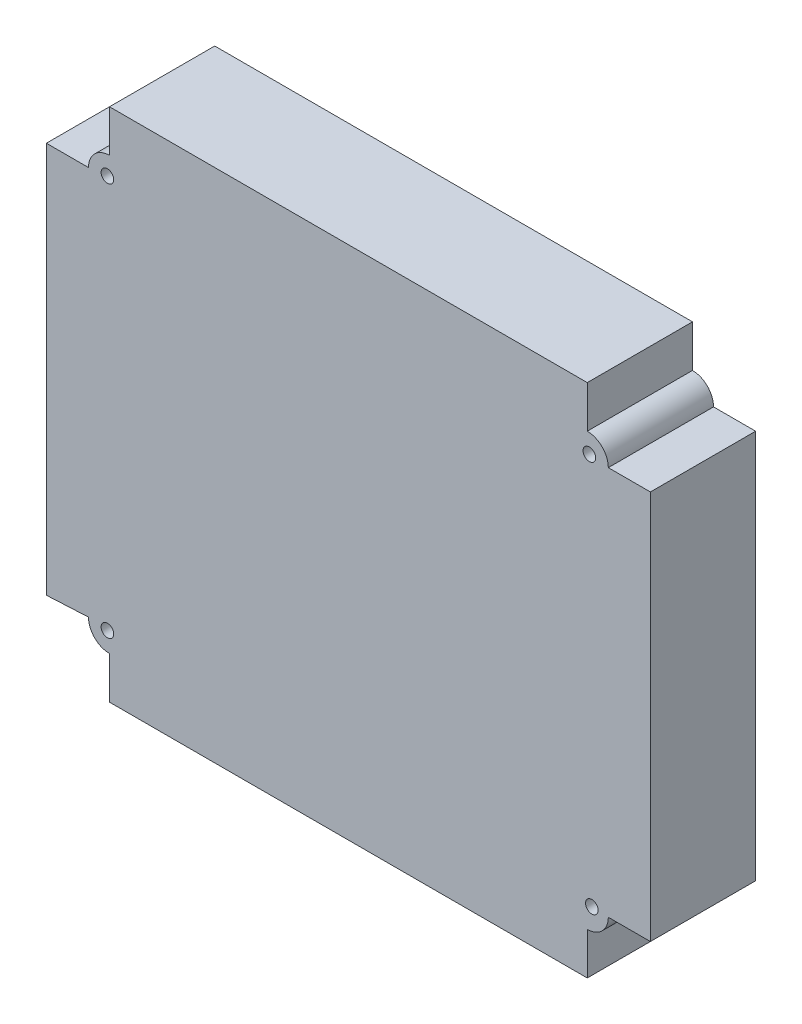
ISO-10303-21;
HEADER;
FILE_DESCRIPTION(('STEP AP214'),'2;1');
FILE_NAME('part.step','',(''),(''),'','','');
FILE_SCHEMA(('AUTOMOTIVE_DESIGN { 1 0 10303 214 1 1 1 1 }'));
ENDSEC;
DATA;
#1=APPLICATION_CONTEXT('core data for automotive mechanical design processes');
#2=APPLICATION_PROTOCOL_DEFINITION('international standard','automotive_design',2000,#1);
#3=PRODUCT_CONTEXT('',#1,'mechanical');
#4=PRODUCT('Part','Part','',(#3));
#5=PRODUCT_RELATED_PRODUCT_CATEGORY('part','',(#4));
#6=PRODUCT_DEFINITION_FORMATION('','',#4);
#7=PRODUCT_DEFINITION_CONTEXT('part definition',#1,'design');
#8=PRODUCT_DEFINITION('design','',#6,#7);
#9=PRODUCT_DEFINITION_SHAPE('','',#8);
#10=(LENGTH_UNIT() NAMED_UNIT(*) SI_UNIT(.MILLI.,.METRE.));
#11=(NAMED_UNIT(*) PLANE_ANGLE_UNIT() SI_UNIT($,.RADIAN.));
#12=(NAMED_UNIT(*) SI_UNIT($,.STERADIAN.) SOLID_ANGLE_UNIT());
#13=UNCERTAINTY_MEASURE_WITH_UNIT(LENGTH_MEASURE(1.E-05),#10,'distance_accuracy_value','');
#14=(GEOMETRIC_REPRESENTATION_CONTEXT(3) GLOBAL_UNCERTAINTY_ASSIGNED_CONTEXT((#13)) GLOBAL_UNIT_ASSIGNED_CONTEXT((#10,
#11,#12)) REPRESENTATION_CONTEXT('',''));
#15=CARTESIAN_POINT('',(0.,0.,0.));
#16=DIRECTION('',(0.,0.,1.));
#17=DIRECTION('',(1.,0.,0.));
#18=AXIS2_PLACEMENT_3D('',#15,#16,#17);
#19=CARTESIAN_POINT('',(-0.98625000004553,5.,25.));
#20=DIRECTION('',(0.,0.,1.));
#21=DIRECTION('',(1.,0.,0.));
#22=AXIS2_PLACEMENT_3D('',#19,#20,#21);
#23=PLANE('',#22);
#24=CARTESIAN_POINT('',(0.095685546854689,5.20116136626515,25.));
#25=DIRECTION('',(0.,0.,1.));
#26=DIRECTION('',(1.,0.,0.));
#27=AXIS2_PLACEMENT_3D('',#24,#25,#26);
#28=CIRCLE('',#27,1.5);
#29=CARTESIAN_POINT('',(1.59568554685469,5.20116136626515,25.));
#30=VERTEX_POINT('',#29);
#31=EDGE_CURVE('E345',#30,#30,#28,.T.);
#32=ORIENTED_EDGE('',*,*,#31,.F.);
#33=EDGE_LOOP('',(#32));
#34=FACE_BOUND('',#33,.T.);
#35=CARTESIAN_POINT('',(-114.986250000046,98.,25.));
#36=DIRECTION('',(0.,0.,1.));
#37=DIRECTION('',(1.,0.,0.));
#38=AXIS2_PLACEMENT_3D('',#35,#36,#37);
#39=CIRCLE('',#38,1.5);
#40=CARTESIAN_POINT('',(-113.486250000046,98.,25.));
#41=VERTEX_POINT('',#40);
#42=EDGE_CURVE('E184',#41,#41,#39,.T.);
#43=ORIENTED_EDGE('',*,*,#42,.F.);
#44=EDGE_LOOP('',(#43));
#45=FACE_BOUND('',#44,.T.);
#46=DIRECTION('',(0.,1.,0.));
#47=VECTOR('',#46,1.);
#48=CARTESIAN_POINT('',(-0.986250000045564,-10.,25.));
#49=LINE('',#48,#47);
#50=CARTESIAN_POINT('',(-0.986250000045564,-10.,25.));
#51=VERTEX_POINT('',#50);
#52=CARTESIAN_POINT('',(-0.986250000045566,0.,25.));
#53=VERTEX_POINT('',#52);
#54=EDGE_CURVE('E211',#51,#53,#49,.T.);
#55=ORIENTED_EDGE('',*,*,#54,.T.);
#56=CARTESIAN_POINT('',(-0.98625000004553,5.,25.));
#57=DIRECTION('',(0.,0.,1.));
#58=DIRECTION('',(1.,0.,0.));
#59=AXIS2_PLACEMENT_3D('',#56,#57,#58);
#60=CIRCLE('',#59,5.);
#61=CARTESIAN_POINT('',(4.01374999995447,5.00000000000003,25.));
#62=VERTEX_POINT('',#61);
#63=EDGE_CURVE('E119',#53,#62,#60,.T.);
#64=ORIENTED_EDGE('',*,*,#63,.T.);
#65=DIRECTION('',(1.,0.,0.));
#66=VECTOR('',#65,1.);
#67=CARTESIAN_POINT('',(4.01374999995447,5.00000000000003,25.));
#68=LINE('',#67,#66);
#69=CARTESIAN_POINT('',(14.0137499999545,5.,25.));
#70=VERTEX_POINT('',#69);
#71=EDGE_CURVE('E250',#62,#70,#68,.T.);
#72=ORIENTED_EDGE('',*,*,#71,.T.);
#73=DIRECTION('',(0.,1.,0.));
#74=VECTOR('',#73,1.);
#75=CARTESIAN_POINT('',(14.0137499999545,5.,25.));
#76=LINE('',#75,#74);
#77=CARTESIAN_POINT('',(14.0137499999545,97.5,25.));
#78=VERTEX_POINT('',#77);
#79=EDGE_CURVE('E269',#70,#78,#76,.T.);
#80=ORIENTED_EDGE('',*,*,#79,.T.);
#81=DIRECTION('',(-1.,0.,0.));
#82=VECTOR('',#81,1.);
#83=CARTESIAN_POINT('',(14.0137499999545,97.5,25.));
#84=LINE('',#83,#82);
#85=CARTESIAN_POINT('',(4.01374999995447,97.5,25.));
#86=VERTEX_POINT('',#85);
#87=EDGE_CURVE('E266',#78,#86,#84,.T.);
#88=ORIENTED_EDGE('',*,*,#87,.T.);
#89=CARTESIAN_POINT('',(-0.986250000045536,97.5,25.));
#90=DIRECTION('',(0.,0.,1.));
#91=DIRECTION('',(-1.,0.,0.));
#92=AXIS2_PLACEMENT_3D('',#89,#90,#91);
#93=CIRCLE('',#92,5.);
#94=CARTESIAN_POINT('',(-0.986250000045571,102.5,25.));
#95=VERTEX_POINT('',#94);
#96=EDGE_CURVE('E268',#86,#95,#93,.T.);
#97=ORIENTED_EDGE('',*,*,#96,.T.);
#98=DIRECTION('',(0.,1.,0.));
#99=VECTOR('',#98,1.);
#100=CARTESIAN_POINT('',(-0.986250000045571,102.5,25.));
#101=LINE('',#100,#99);
#102=CARTESIAN_POINT('',(-0.986250000045541,112.5,25.));
#103=VERTEX_POINT('',#102);
#104=EDGE_CURVE('E271',#95,#103,#101,.T.);
#105=ORIENTED_EDGE('',*,*,#104,.T.);
#106=DIRECTION('',(-1.,0.,0.));
#107=VECTOR('',#106,1.);
#108=CARTESIAN_POINT('',(-0.986250000045541,112.5,25.));
#109=LINE('',#108,#107);
#110=CARTESIAN_POINT('',(-114.486250000045,112.5,25.));
#111=VERTEX_POINT('',#110);
#112=EDGE_CURVE('E277',#103,#111,#109,.T.);
#113=ORIENTED_EDGE('',*,*,#112,.T.);
#114=DIRECTION('',(0.,-1.,0.));
#115=VECTOR('',#114,1.);
#116=CARTESIAN_POINT('',(-114.486250000045,112.5,25.));
#117=LINE('',#116,#115);
#118=CARTESIAN_POINT('',(-114.486250000045,102.5,25.));
#119=VERTEX_POINT('',#118);
#120=EDGE_CURVE('E279',#111,#119,#117,.T.);
#121=ORIENTED_EDGE('',*,*,#120,.T.);
#122=CARTESIAN_POINT('',(-114.486250000046,97.5,25.));
#123=DIRECTION('',(0.,0.,1.));
#124=DIRECTION('',(1.,0.,0.));
#125=AXIS2_PLACEMENT_3D('',#122,#123,#124);
#126=CIRCLE('',#125,5.);
#127=CARTESIAN_POINT('',(-119.486250000046,97.5,25.));
#128=VERTEX_POINT('',#127);
#129=EDGE_CURVE('E281',#119,#128,#126,.T.);
#130=ORIENTED_EDGE('',*,*,#129,.T.);
#131=DIRECTION('',(-1.,0.,0.));
#132=VECTOR('',#131,1.);
#133=CARTESIAN_POINT('',(-119.486250000046,97.5,25.));
#134=LINE('',#133,#132);
#135=CARTESIAN_POINT('',(-129.486250000046,97.5,25.));
#136=VERTEX_POINT('',#135);
#137=EDGE_CURVE('E283',#128,#136,#134,.T.);
#138=ORIENTED_EDGE('',*,*,#137,.T.);
#139=DIRECTION('',(0.,-1.,0.));
#140=VECTOR('',#139,1.);
#141=CARTESIAN_POINT('',(-129.486250000046,97.5,25.));
#142=LINE('',#141,#140);
#143=CARTESIAN_POINT('',(-129.486250000046,4.5,25.));
#144=VERTEX_POINT('',#143);
#145=EDGE_CURVE('E285',#136,#144,#142,.T.);
#146=ORIENTED_EDGE('',*,*,#145,.T.);
#147=DIRECTION('',(0.998752338877845,0.0499376169438958,0.));
#148=VECTOR('',#147,1.);
#149=CARTESIAN_POINT('',(-129.486250000046,4.5,25.));
#150=LINE('',#149,#148);
#151=CARTESIAN_POINT('',(-119.486250000046,5.00000000000003,25.));
#152=VERTEX_POINT('',#151);
#153=EDGE_CURVE('E162',#144,#152,#150,.T.);
#154=ORIENTED_EDGE('',*,*,#153,.T.);
#155=CARTESIAN_POINT('',(-114.486250000046,5.,25.));
#156=DIRECTION('',(0.,0.,1.));
#157=DIRECTION('',(1.,0.,0.));
#158=AXIS2_PLACEMENT_3D('',#155,#156,#157);
#159=CIRCLE('',#158,5.);
#160=CARTESIAN_POINT('',(-114.486250000045,0.,25.));
#161=VERTEX_POINT('',#160);
#162=EDGE_CURVE('E156',#152,#161,#159,.T.);
#163=ORIENTED_EDGE('',*,*,#162,.T.);
#164=DIRECTION('',(0.,-1.,0.));
#165=VECTOR('',#164,1.);
#166=CARTESIAN_POINT('',(-114.486250000045,0.,25.));
#167=LINE('',#166,#165);
#168=CARTESIAN_POINT('',(-114.486250000046,-10.,25.));
#169=VERTEX_POINT('',#168);
#170=EDGE_CURVE('E160',#161,#169,#167,.T.);
#171=ORIENTED_EDGE('',*,*,#170,.T.);
#172=DIRECTION('',(1.,0.,0.));
#173=VECTOR('',#172,1.);
#174=CARTESIAN_POINT('',(-114.486250000046,-10.,25.));
#175=LINE('',#174,#173);
#176=EDGE_CURVE('E52',#169,#51,#175,.T.);
#177=ORIENTED_EDGE('',*,*,#176,.T.);
#178=EDGE_LOOP('',(#55,#64,#72,#80,#88,#97,#105,#113,#121,#130,#138,#146,#154,#163,#171,#177));
#179=FACE_BOUND('',#178,.T.);
#180=CARTESIAN_POINT('',(-114.986250000046,4.5,25.));
#181=DIRECTION('',(0.,0.,1.));
#182=DIRECTION('',(1.,0.,0.));
#183=AXIS2_PLACEMENT_3D('',#180,#181,#182);
#184=CIRCLE('',#183,1.5);
#185=CARTESIAN_POINT('',(-113.486250000046,4.5,25.));
#186=VERTEX_POINT('',#185);
#187=EDGE_CURVE('E351',#186,#186,#184,.T.);
#188=ORIENTED_EDGE('',*,*,#187,.F.);
#189=EDGE_LOOP('',(#188));
#190=FACE_BOUND('',#189,.T.);
#191=CARTESIAN_POINT('',(-0.486250000045534,98.,25.));
#192=DIRECTION('',(0.,0.,1.));
#193=DIRECTION('',(1.,0.,0.));
#194=AXIS2_PLACEMENT_3D('',#191,#192,#193);
#195=CIRCLE('',#194,1.5);
#196=CARTESIAN_POINT('',(1.01374999995447,98.,25.));
#197=VERTEX_POINT('',#196);
#198=EDGE_CURVE('E336',#197,#197,#195,.T.);
#199=ORIENTED_EDGE('',*,*,#198,.F.);
#200=EDGE_LOOP('',(#199));
#201=FACE_BOUND('',#200,.T.);
#202=ADVANCED_FACE('F35',(#34,#45,#179,#190,#201),#23,.T.);
#203=CARTESIAN_POINT('',(-0.98625000004553,5.,0.));
#204=DIRECTION('',(0.,0.,1.));
#205=DIRECTION('',(1.,0.,0.));
#206=AXIS2_PLACEMENT_3D('',#203,#204,#205);
#207=PLANE('',#206);
#208=DIRECTION('',(0.,1.,0.));
#209=VECTOR('',#208,1.);
#210=CARTESIAN_POINT('',(-0.986250000045564,-10.,0.));
#211=LINE('',#210,#209);
#212=CARTESIAN_POINT('',(-0.986250000045564,-10.,0.));
#213=VERTEX_POINT('',#212);
#214=CARTESIAN_POINT('',(-0.986250000045566,0.,0.));
#215=VERTEX_POINT('',#214);
#216=EDGE_CURVE('E180',#213,#215,#211,.T.);
#217=ORIENTED_EDGE('',*,*,#216,.F.);
#218=DIRECTION('',(1.,0.,0.));
#219=VECTOR('',#218,1.);
#220=CARTESIAN_POINT('',(-114.486250000046,-10.,0.));
#221=LINE('',#220,#219);
#222=CARTESIAN_POINT('',(-114.486250000046,-10.,0.));
#223=VERTEX_POINT('',#222);
#224=EDGE_CURVE('E111',#223,#213,#221,.T.);
#225=ORIENTED_EDGE('',*,*,#224,.F.);
#226=DIRECTION('',(0.,-1.,0.));
#227=VECTOR('',#226,1.);
#228=CARTESIAN_POINT('',(-114.486250000045,0.,0.));
#229=LINE('',#228,#227);
#230=CARTESIAN_POINT('',(-114.486250000045,0.,0.));
#231=VERTEX_POINT('',#230);
#232=EDGE_CURVE('E105',#231,#223,#229,.T.);
#233=ORIENTED_EDGE('',*,*,#232,.F.);
#234=CARTESIAN_POINT('',(-114.486250000046,5.,0.));
#235=DIRECTION('',(0.,0.,1.));
#236=DIRECTION('',(1.,0.,0.));
#237=AXIS2_PLACEMENT_3D('',#234,#235,#236);
#238=CIRCLE('',#237,5.);
#239=CARTESIAN_POINT('',(-119.486250000046,5.00000000000003,0.));
#240=VERTEX_POINT('',#239);
#241=EDGE_CURVE('E170',#240,#231,#238,.T.);
#242=ORIENTED_EDGE('',*,*,#241,.F.);
#243=DIRECTION('',(0.998752338877845,0.0499376169438958,0.));
#244=VECTOR('',#243,1.);
#245=CARTESIAN_POINT('',(-129.486250000046,4.5,0.));
#246=LINE('',#245,#244);
#247=CARTESIAN_POINT('',(-129.486250000046,4.5,0.));
#248=VERTEX_POINT('',#247);
#249=EDGE_CURVE('E206',#248,#240,#246,.T.);
#250=ORIENTED_EDGE('',*,*,#249,.F.);
#251=DIRECTION('',(0.,-1.,0.));
#252=VECTOR('',#251,1.);
#253=CARTESIAN_POINT('',(-129.486250000046,97.5,0.));
#254=LINE('',#253,#252);
#255=CARTESIAN_POINT('',(-129.486250000046,97.5,0.));
#256=VERTEX_POINT('',#255);
#257=EDGE_CURVE('E204',#256,#248,#254,.T.);
#258=ORIENTED_EDGE('',*,*,#257,.F.);
#259=DIRECTION('',(-1.,0.,0.));
#260=VECTOR('',#259,1.);
#261=CARTESIAN_POINT('',(-119.486250000046,97.5,0.));
#262=LINE('',#261,#260);
#263=CARTESIAN_POINT('',(-119.486250000046,97.5,0.));
#264=VERTEX_POINT('',#263);
#265=EDGE_CURVE('E202',#264,#256,#262,.T.);
#266=ORIENTED_EDGE('',*,*,#265,.F.);
#267=CARTESIAN_POINT('',(-114.486250000046,97.5,0.));
#268=DIRECTION('',(0.,0.,1.));
#269=DIRECTION('',(1.,0.,0.));
#270=AXIS2_PLACEMENT_3D('',#267,#268,#269);
#271=CIRCLE('',#270,5.);
#272=CARTESIAN_POINT('',(-114.486250000045,102.5,0.));
#273=VERTEX_POINT('',#272);
#274=EDGE_CURVE('E200',#273,#264,#271,.T.);
#275=ORIENTED_EDGE('',*,*,#274,.F.);
#276=DIRECTION('',(0.,-1.,0.));
#277=VECTOR('',#276,1.);
#278=CARTESIAN_POINT('',(-114.486250000045,112.5,0.));
#279=LINE('',#278,#277);
#280=CARTESIAN_POINT('',(-114.486250000045,112.5,0.));
#281=VERTEX_POINT('',#280);
#282=EDGE_CURVE('E198',#281,#273,#279,.T.);
#283=ORIENTED_EDGE('',*,*,#282,.F.);
#284=DIRECTION('',(-1.,0.,0.));
#285=VECTOR('',#284,1.);
#286=CARTESIAN_POINT('',(-0.986250000045541,112.5,0.));
#287=LINE('',#286,#285);
#288=CARTESIAN_POINT('',(-0.986250000045541,112.5,0.));
#289=VERTEX_POINT('',#288);
#290=EDGE_CURVE('E196',#289,#281,#287,.T.);
#291=ORIENTED_EDGE('',*,*,#290,.F.);
#292=DIRECTION('',(0.,1.,0.));
#293=VECTOR('',#292,1.);
#294=CARTESIAN_POINT('',(-0.986250000045571,102.5,0.));
#295=LINE('',#294,#293);
#296=CARTESIAN_POINT('',(-0.986250000045571,102.5,0.));
#297=VERTEX_POINT('',#296);
#298=EDGE_CURVE('E194',#297,#289,#295,.T.);
#299=ORIENTED_EDGE('',*,*,#298,.F.);
#300=CARTESIAN_POINT('',(-0.986250000045536,97.5,0.));
#301=DIRECTION('',(0.,0.,1.));
#302=DIRECTION('',(-1.,0.,0.));
#303=AXIS2_PLACEMENT_3D('',#300,#301,#302);
#304=CIRCLE('',#303,5.);
#305=CARTESIAN_POINT('',(4.01374999995447,97.5,0.));
#306=VERTEX_POINT('',#305);
#307=EDGE_CURVE('E192',#306,#297,#304,.T.);
#308=ORIENTED_EDGE('',*,*,#307,.F.);
#309=DIRECTION('',(-1.,0.,0.));
#310=VECTOR('',#309,1.);
#311=CARTESIAN_POINT('',(14.0137499999545,97.5,0.));
#312=LINE('',#311,#310);
#313=CARTESIAN_POINT('',(14.0137499999545,97.5,0.));
#314=VERTEX_POINT('',#313);
#315=EDGE_CURVE('E190',#314,#306,#312,.T.);
#316=ORIENTED_EDGE('',*,*,#315,.F.);
#317=DIRECTION('',(0.,1.,0.));
#318=VECTOR('',#317,1.);
#319=CARTESIAN_POINT('',(14.0137499999545,5.,0.));
#320=LINE('',#319,#318);
#321=CARTESIAN_POINT('',(14.0137499999545,5.,0.));
#322=VERTEX_POINT('',#321);
#323=EDGE_CURVE('E188',#322,#314,#320,.T.);
#324=ORIENTED_EDGE('',*,*,#323,.F.);
#325=DIRECTION('',(1.,0.,0.));
#326=VECTOR('',#325,1.);
#327=CARTESIAN_POINT('',(4.01374999995447,5.00000000000003,0.));
#328=LINE('',#327,#326);
#329=CARTESIAN_POINT('',(4.01374999995447,5.00000000000003,0.));
#330=VERTEX_POINT('',#329);
#331=EDGE_CURVE('E186',#330,#322,#328,.T.);
#332=ORIENTED_EDGE('',*,*,#331,.F.);
#333=CARTESIAN_POINT('',(-0.98625000004553,5.,0.));
#334=DIRECTION('',(0.,0.,1.));
#335=DIRECTION('',(1.,0.,0.));
#336=AXIS2_PLACEMENT_3D('',#333,#334,#335);
#337=CIRCLE('',#336,5.);
#338=EDGE_CURVE('E183',#215,#330,#337,.T.);
#339=ORIENTED_EDGE('',*,*,#338,.F.);
#340=EDGE_LOOP('',(#217,#225,#233,#242,#250,#258,#266,#275,#283,#291,#299,#308,#316,#324,#332,#339));
#341=FACE_BOUND('',#340,.T.);
#342=CARTESIAN_POINT('',(-114.986250000046,98.,0.));
#343=DIRECTION('',(0.,0.,1.));
#344=DIRECTION('',(1.,0.,0.));
#345=AXIS2_PLACEMENT_3D('',#342,#343,#344);
#346=CIRCLE('',#345,1.5);
#347=CARTESIAN_POINT('',(-113.486250000046,98.,0.));
#348=VERTEX_POINT('',#347);
#349=EDGE_CURVE('E354',#348,#348,#346,.T.);
#350=ORIENTED_EDGE('',*,*,#349,.T.);
#351=EDGE_LOOP('',(#350));
#352=FACE_BOUND('',#351,.T.);
#353=CARTESIAN_POINT('',(-114.986250000046,4.5,0.));
#354=DIRECTION('',(0.,0.,1.));
#355=DIRECTION('',(1.,0.,0.));
#356=AXIS2_PLACEMENT_3D('',#353,#354,#355);
#357=CIRCLE('',#356,1.5);
#358=CARTESIAN_POINT('',(-113.486250000046,4.5,0.));
#359=VERTEX_POINT('',#358);
#360=EDGE_CURVE('E348',#359,#359,#357,.T.);
#361=ORIENTED_EDGE('',*,*,#360,.T.);
#362=EDGE_LOOP('',(#361));
#363=FACE_BOUND('',#362,.T.);
#364=CARTESIAN_POINT('',(0.095685546854689,5.20116136626515,0.));
#365=DIRECTION('',(0.,0.,1.));
#366=DIRECTION('',(1.,0.,0.));
#367=AXIS2_PLACEMENT_3D('',#364,#365,#366);
#368=CIRCLE('',#367,1.5);
#369=CARTESIAN_POINT('',(1.59568554685469,5.20116136626515,0.));
#370=VERTEX_POINT('',#369);
#371=EDGE_CURVE('E342',#370,#370,#368,.T.);
#372=ORIENTED_EDGE('',*,*,#371,.T.);
#373=EDGE_LOOP('',(#372));
#374=FACE_BOUND('',#373,.T.);
#375=CARTESIAN_POINT('',(-0.486250000045534,98.,0.));
#376=DIRECTION('',(0.,0.,1.));
#377=DIRECTION('',(1.,0.,0.));
#378=AXIS2_PLACEMENT_3D('',#375,#376,#377);
#379=CIRCLE('',#378,1.5);
#380=CARTESIAN_POINT('',(1.01374999995447,98.,0.));
#381=VERTEX_POINT('',#380);
#382=EDGE_CURVE('E339',#381,#381,#379,.T.);
#383=ORIENTED_EDGE('',*,*,#382,.T.);
#384=EDGE_LOOP('',(#383));
#385=FACE_BOUND('',#384,.T.);
#386=ADVANCED_FACE('F254',(#341,#352,#363,#374,#385),#207,.F.);
#387=CARTESIAN_POINT('',(-0.986250000045564,-10.,25.));
#388=DIRECTION('',(-1.,0.,0.));
#389=DIRECTION('',(0.,0.,1.));
#390=AXIS2_PLACEMENT_3D('',#387,#388,#389);
#391=PLANE('',#390);
#392=ORIENTED_EDGE('',*,*,#216,.T.);
#393=DIRECTION('',(0.,0.,-1.));
#394=VECTOR('',#393,1.);
#395=CARTESIAN_POINT('',(-0.986250000045566,0.,25.));
#396=LINE('',#395,#394);
#397=EDGE_CURVE('E11',#53,#215,#396,.T.);
#398=ORIENTED_EDGE('',*,*,#397,.F.);
#399=ORIENTED_EDGE('',*,*,#54,.F.);
#400=DIRECTION('',(0.,0.,-1.));
#401=VECTOR('',#400,1.);
#402=CARTESIAN_POINT('',(-0.986250000045564,-10.,25.));
#403=LINE('',#402,#401);
#404=EDGE_CURVE('E176',#51,#213,#403,.T.);
#405=ORIENTED_EDGE('',*,*,#404,.T.);
#406=EDGE_LOOP('',(#392,#398,#399,#405));
#407=FACE_BOUND('',#406,.T.);
#408=ADVANCED_FACE('F37',(#407),#391,.F.);
#409=CARTESIAN_POINT('',(-0.98625000004553,5.,25.));
#410=DIRECTION('',(0.,0.,-1.));
#411=DIRECTION('',(-1.,0.,0.));
#412=AXIS2_PLACEMENT_3D('',#409,#410,#411);
#413=CYLINDRICAL_SURFACE('',#412,5.);
#414=ORIENTED_EDGE('',*,*,#338,.T.);
#415=DIRECTION('',(0.,0.,-1.));
#416=VECTOR('',#415,1.);
#417=CARTESIAN_POINT('',(4.01374999995447,5.00000000000003,25.));
#418=LINE('',#417,#416);
#419=EDGE_CURVE('E44',#62,#330,#418,.T.);
#420=ORIENTED_EDGE('',*,*,#419,.F.);
#421=ORIENTED_EDGE('',*,*,#63,.F.);
#422=ORIENTED_EDGE('',*,*,#397,.T.);
#423=EDGE_LOOP('',(#414,#420,#421,#422));
#424=FACE_BOUND('',#423,.T.);
#425=ADVANCED_FACE('F504',(#424),#413,.T.);
#426=CARTESIAN_POINT('',(4.01374999995447,5.00000000000003,25.));
#427=DIRECTION('',(0.,1.,0.));
#428=DIRECTION('',(-1.,0.,0.));
#429=AXIS2_PLACEMENT_3D('',#426,#427,#428);
#430=PLANE('',#429);
#431=ORIENTED_EDGE('',*,*,#331,.T.);
#432=DIRECTION('',(0.,0.,-1.));
#433=VECTOR('',#432,1.);
#434=CARTESIAN_POINT('',(14.0137499999545,5.,25.));
#435=LINE('',#434,#433);
#436=EDGE_CURVE('E242',#70,#322,#435,.T.);
#437=ORIENTED_EDGE('',*,*,#436,.F.);
#438=ORIENTED_EDGE('',*,*,#71,.F.);
#439=ORIENTED_EDGE('',*,*,#419,.T.);
#440=EDGE_LOOP('',(#431,#437,#438,#439));
#441=FACE_BOUND('',#440,.T.);
#442=ADVANCED_FACE('F248',(#441),#430,.F.);
#443=CARTESIAN_POINT('',(14.0137499999545,5.,25.));
#444=DIRECTION('',(-1.,0.,0.));
#445=DIRECTION('',(0.,0.,1.));
#446=AXIS2_PLACEMENT_3D('',#443,#444,#445);
#447=PLANE('',#446);
#448=ORIENTED_EDGE('',*,*,#323,.T.);
#449=DIRECTION('',(0.,0.,-1.));
#450=VECTOR('',#449,1.);
#451=CARTESIAN_POINT('',(14.0137499999545,97.5,25.));
#452=LINE('',#451,#450);
#453=EDGE_CURVE('E239',#78,#314,#452,.T.);
#454=ORIENTED_EDGE('',*,*,#453,.F.);
#455=ORIENTED_EDGE('',*,*,#79,.F.);
#456=ORIENTED_EDGE('',*,*,#436,.T.);
#457=EDGE_LOOP('',(#448,#454,#455,#456));
#458=FACE_BOUND('',#457,.T.);
#459=ADVANCED_FACE('F260',(#458),#447,.F.);
#460=CARTESIAN_POINT('',(14.0137499999545,97.5,25.));
#461=DIRECTION('',(0.,-1.,0.));
#462=DIRECTION('',(1.,0.,0.));
#463=AXIS2_PLACEMENT_3D('',#460,#461,#462);
#464=PLANE('',#463);
#465=ORIENTED_EDGE('',*,*,#315,.T.);
#466=DIRECTION('',(0.,0.,-1.));
#467=VECTOR('',#466,1.);
#468=CARTESIAN_POINT('',(4.01374999995447,97.5,25.));
#469=LINE('',#468,#467);
#470=EDGE_CURVE('E236',#86,#306,#469,.T.);
#471=ORIENTED_EDGE('',*,*,#470,.F.);
#472=ORIENTED_EDGE('',*,*,#87,.F.);
#473=ORIENTED_EDGE('',*,*,#453,.T.);
#474=EDGE_LOOP('',(#465,#471,#472,#473));
#475=FACE_BOUND('',#474,.T.);
#476=ADVANCED_FACE('F264',(#475),#464,.F.);
#477=CARTESIAN_POINT('',(-0.986250000045536,97.5,25.));
#478=DIRECTION('',(0.,0.,-1.));
#479=DIRECTION('',(-1.,0.,0.));
#480=AXIS2_PLACEMENT_3D('',#477,#478,#479);
#481=CYLINDRICAL_SURFACE('',#480,5.);
#482=ORIENTED_EDGE('',*,*,#307,.T.);
#483=DIRECTION('',(0.,0.,-1.));
#484=VECTOR('',#483,1.);
#485=CARTESIAN_POINT('',(-0.986250000045571,102.5,25.));
#486=LINE('',#485,#484);
#487=EDGE_CURVE('E233',#95,#297,#486,.T.);
#488=ORIENTED_EDGE('',*,*,#487,.F.);
#489=ORIENTED_EDGE('',*,*,#96,.F.);
#490=ORIENTED_EDGE('',*,*,#470,.T.);
#491=EDGE_LOOP('',(#482,#488,#489,#490));
#492=FACE_BOUND('',#491,.T.);
#493=ADVANCED_FACE('F469',(#492),#481,.T.);
#494=CARTESIAN_POINT('',(-0.986250000045571,102.5,25.));
#495=DIRECTION('',(-1.,0.,0.));
#496=DIRECTION('',(0.,-1.,0.));
#497=AXIS2_PLACEMENT_3D('',#494,#495,#496);
#498=PLANE('',#497);
#499=ORIENTED_EDGE('',*,*,#298,.T.);
#500=DIRECTION('',(0.,0.,-1.));
#501=VECTOR('',#500,1.);
#502=CARTESIAN_POINT('',(-0.986250000045541,112.5,25.));
#503=LINE('',#502,#501);
#504=EDGE_CURVE('E230',#103,#289,#503,.T.);
#505=ORIENTED_EDGE('',*,*,#504,.F.);
#506=ORIENTED_EDGE('',*,*,#104,.F.);
#507=ORIENTED_EDGE('',*,*,#487,.T.);
#508=EDGE_LOOP('',(#499,#505,#506,#507));
#509=FACE_BOUND('',#508,.T.);
#510=ADVANCED_FACE('F459',(#509),#498,.F.);
#511=CARTESIAN_POINT('',(-0.986250000045541,112.5,25.));
#512=DIRECTION('',(0.,-1.,0.));
#513=DIRECTION('',(0.,0.,-1.));
#514=AXIS2_PLACEMENT_3D('',#511,#512,#513);
#515=PLANE('',#514);
#516=ORIENTED_EDGE('',*,*,#290,.T.);
#517=DIRECTION('',(0.,0.,-1.));
#518=VECTOR('',#517,1.);
#519=CARTESIAN_POINT('',(-114.486250000045,112.5,25.));
#520=LINE('',#519,#518);
#521=EDGE_CURVE('E227',#111,#281,#520,.T.);
#522=ORIENTED_EDGE('',*,*,#521,.F.);
#523=ORIENTED_EDGE('',*,*,#112,.F.);
#524=ORIENTED_EDGE('',*,*,#504,.T.);
#525=EDGE_LOOP('',(#516,#522,#523,#524));
#526=FACE_BOUND('',#525,.T.);
#527=ADVANCED_FACE('F449',(#526),#515,.F.);
#528=CARTESIAN_POINT('',(-114.486250000045,112.5,25.));
#529=DIRECTION('',(1.,0.,0.));
#530=DIRECTION('',(0.,0.,-1.));
#531=AXIS2_PLACEMENT_3D('',#528,#529,#530);
#532=PLANE('',#531);
#533=ORIENTED_EDGE('',*,*,#282,.T.);
#534=DIRECTION('',(0.,0.,-1.));
#535=VECTOR('',#534,1.);
#536=CARTESIAN_POINT('',(-114.486250000045,102.5,25.));
#537=LINE('',#536,#535);
#538=EDGE_CURVE('E224',#119,#273,#537,.T.);
#539=ORIENTED_EDGE('',*,*,#538,.F.);
#540=ORIENTED_EDGE('',*,*,#120,.F.);
#541=ORIENTED_EDGE('',*,*,#521,.T.);
#542=EDGE_LOOP('',(#533,#539,#540,#541));
#543=FACE_BOUND('',#542,.T.);
#544=ADVANCED_FACE('F439',(#543),#532,.F.);
#545=CARTESIAN_POINT('',(-114.486250000046,97.5,25.));
#546=DIRECTION('',(0.,0.,-1.));
#547=DIRECTION('',(-1.,0.,0.));
#548=AXIS2_PLACEMENT_3D('',#545,#546,#547);
#549=CYLINDRICAL_SURFACE('',#548,5.);
#550=ORIENTED_EDGE('',*,*,#274,.T.);
#551=DIRECTION('',(0.,0.,-1.));
#552=VECTOR('',#551,1.);
#553=CARTESIAN_POINT('',(-119.486250000046,97.5,25.));
#554=LINE('',#553,#552);
#555=EDGE_CURVE('E221',#128,#264,#554,.T.);
#556=ORIENTED_EDGE('',*,*,#555,.F.);
#557=ORIENTED_EDGE('',*,*,#129,.F.);
#558=ORIENTED_EDGE('',*,*,#538,.T.);
#559=EDGE_LOOP('',(#550,#556,#557,#558));
#560=FACE_BOUND('',#559,.T.);
#561=ADVANCED_FACE('F429',(#560),#549,.T.);
#562=CARTESIAN_POINT('',(-119.486250000046,97.5,25.));
#563=DIRECTION('',(0.,-1.,0.));
#564=DIRECTION('',(1.,0.,0.));
#565=AXIS2_PLACEMENT_3D('',#562,#563,#564);
#566=PLANE('',#565);
#567=ORIENTED_EDGE('',*,*,#265,.T.);
#568=DIRECTION('',(0.,0.,-1.));
#569=VECTOR('',#568,1.);
#570=CARTESIAN_POINT('',(-129.486250000046,97.5,25.));
#571=LINE('',#570,#569);
#572=EDGE_CURVE('E218',#136,#256,#571,.T.);
#573=ORIENTED_EDGE('',*,*,#572,.F.);
#574=ORIENTED_EDGE('',*,*,#137,.F.);
#575=ORIENTED_EDGE('',*,*,#555,.T.);
#576=EDGE_LOOP('',(#567,#573,#574,#575));
#577=FACE_BOUND('',#576,.T.);
#578=ADVANCED_FACE('F420',(#577),#566,.F.);
#579=CARTESIAN_POINT('',(-129.486250000046,97.5,25.));
#580=DIRECTION('',(1.,0.,0.));
#581=DIRECTION('',(0.,0.,-1.));
#582=AXIS2_PLACEMENT_3D('',#579,#580,#581);
#583=PLANE('',#582);
#584=ORIENTED_EDGE('',*,*,#257,.T.);
#585=DIRECTION('',(0.,0.,-1.));
#586=VECTOR('',#585,1.);
#587=CARTESIAN_POINT('',(-129.486250000046,4.5,25.));
#588=LINE('',#587,#586);
#589=EDGE_CURVE('E215',#144,#248,#588,.T.);
#590=ORIENTED_EDGE('',*,*,#589,.F.);
#591=ORIENTED_EDGE('',*,*,#145,.F.);
#592=ORIENTED_EDGE('',*,*,#572,.T.);
#593=EDGE_LOOP('',(#584,#590,#591,#592));
#594=FACE_BOUND('',#593,.T.);
#595=ADVANCED_FACE('F291',(#594),#583,.F.);
#596=CARTESIAN_POINT('',(-129.486250000046,4.5,25.));
#597=DIRECTION('',(-0.0499376169438958,0.998752338877844,0.));
#598=DIRECTION('',(-0.998752338877845,-0.0499376169438958,0.));
#599=AXIS2_PLACEMENT_3D('',#596,#597,#598);
#600=PLANE('',#599);
#601=ORIENTED_EDGE('',*,*,#249,.T.);
#602=DIRECTION('',(0.,0.,-1.));
#603=VECTOR('',#602,1.);
#604=CARTESIAN_POINT('',(-119.486250000046,5.00000000000003,25.));
#605=LINE('',#604,#603);
#606=EDGE_CURVE('E171',#152,#240,#605,.T.);
#607=ORIENTED_EDGE('',*,*,#606,.F.);
#608=ORIENTED_EDGE('',*,*,#153,.F.);
#609=ORIENTED_EDGE('',*,*,#589,.T.);
#610=EDGE_LOOP('',(#601,#607,#608,#609));
#611=FACE_BOUND('',#610,.T.);
#612=ADVANCED_FACE('F295',(#611),#600,.F.);
#613=CARTESIAN_POINT('',(-114.486250000046,5.,25.));
#614=DIRECTION('',(0.,0.,-1.));
#615=DIRECTION('',(-1.,0.,0.));
#616=AXIS2_PLACEMENT_3D('',#613,#614,#615);
#617=CYLINDRICAL_SURFACE('',#616,5.);
#618=ORIENTED_EDGE('',*,*,#241,.T.);
#619=DIRECTION('',(0.,0.,-1.));
#620=VECTOR('',#619,1.);
#621=CARTESIAN_POINT('',(-114.486250000045,0.,25.));
#622=LINE('',#621,#620);
#623=EDGE_CURVE('E167',#161,#231,#622,.T.);
#624=ORIENTED_EDGE('',*,*,#623,.F.);
#625=ORIENTED_EDGE('',*,*,#162,.F.);
#626=ORIENTED_EDGE('',*,*,#606,.T.);
#627=EDGE_LOOP('',(#618,#624,#625,#626));
#628=FACE_BOUND('',#627,.T.);
#629=ADVANCED_FACE('F168',(#628),#617,.T.);
#630=CARTESIAN_POINT('',(-114.486250000045,0.,25.));
#631=DIRECTION('',(1.,0.,0.));
#632=DIRECTION('',(0.,1.,0.));
#633=AXIS2_PLACEMENT_3D('',#630,#631,#632);
#634=PLANE('',#633);
#635=ORIENTED_EDGE('',*,*,#232,.T.);
#636=DIRECTION('',(0.,0.,-1.));
#637=VECTOR('',#636,1.);
#638=CARTESIAN_POINT('',(-114.486250000046,-10.,25.));
#639=LINE('',#638,#637);
#640=EDGE_CURVE('E172',#169,#223,#639,.T.);
#641=ORIENTED_EDGE('',*,*,#640,.F.);
#642=ORIENTED_EDGE('',*,*,#170,.F.);
#643=ORIENTED_EDGE('',*,*,#623,.T.);
#644=EDGE_LOOP('',(#635,#641,#642,#643));
#645=FACE_BOUND('',#644,.T.);
#646=ADVANCED_FACE('F174',(#645),#634,.F.);
#647=CARTESIAN_POINT('',(-114.486250000046,-10.,25.));
#648=DIRECTION('',(0.,1.,0.));
#649=DIRECTION('',(0.,0.,1.));
#650=AXIS2_PLACEMENT_3D('',#647,#648,#649);
#651=PLANE('',#650);
#652=ORIENTED_EDGE('',*,*,#224,.T.);
#653=ORIENTED_EDGE('',*,*,#404,.F.);
#654=ORIENTED_EDGE('',*,*,#176,.F.);
#655=ORIENTED_EDGE('',*,*,#640,.T.);
#656=EDGE_LOOP('',(#652,#653,#654,#655));
#657=FACE_BOUND('',#656,.T.);
#658=ADVANCED_FACE('F299',(#657),#651,.F.);
#659=CARTESIAN_POINT('',(-114.986250000046,98.,25.));
#660=DIRECTION('',(0.,0.,-1.));
#661=DIRECTION('',(-1.,0.,0.));
#662=AXIS2_PLACEMENT_3D('',#659,#660,#661);
#663=CYLINDRICAL_SURFACE('',#662,1.5);
#664=ORIENTED_EDGE('',*,*,#42,.T.);
#665=EDGE_LOOP('',(#664));
#666=FACE_BOUND('',#665,.T.);
#667=ORIENTED_EDGE('',*,*,#349,.F.);
#668=EDGE_LOOP('',(#667));
#669=FACE_BOUND('',#668,.T.);
#670=ADVANCED_FACE('F301',(#666,#669),#663,.F.);
#671=CARTESIAN_POINT('',(-114.986250000046,4.5,25.));
#672=DIRECTION('',(0.,0.,-1.));
#673=DIRECTION('',(-1.,0.,0.));
#674=AXIS2_PLACEMENT_3D('',#671,#672,#673);
#675=CYLINDRICAL_SURFACE('',#674,1.5);
#676=ORIENTED_EDGE('',*,*,#187,.T.);
#677=EDGE_LOOP('',(#676));
#678=FACE_BOUND('',#677,.T.);
#679=ORIENTED_EDGE('',*,*,#360,.F.);
#680=EDGE_LOOP('',(#679));
#681=FACE_BOUND('',#680,.T.);
#682=ADVANCED_FACE('F307',(#678,#681),#675,.F.);
#683=CARTESIAN_POINT('',(0.095685546854689,5.20116136626515,25.));
#684=DIRECTION('',(0.,0.,-1.));
#685=DIRECTION('',(-1.,0.,0.));
#686=AXIS2_PLACEMENT_3D('',#683,#684,#685);
#687=CYLINDRICAL_SURFACE('',#686,1.5);
#688=ORIENTED_EDGE('',*,*,#31,.T.);
#689=EDGE_LOOP('',(#688));
#690=FACE_BOUND('',#689,.T.);
#691=ORIENTED_EDGE('',*,*,#371,.F.);
#692=EDGE_LOOP('',(#691));
#693=FACE_BOUND('',#692,.T.);
#694=ADVANCED_FACE('F323',(#690,#693),#687,.F.);
#695=CARTESIAN_POINT('',(-0.486250000045534,98.,25.));
#696=DIRECTION('',(0.,0.,-1.));
#697=DIRECTION('',(-1.,0.,0.));
#698=AXIS2_PLACEMENT_3D('',#695,#696,#697);
#699=CYLINDRICAL_SURFACE('',#698,1.5);
#700=ORIENTED_EDGE('',*,*,#198,.T.);
#701=EDGE_LOOP('',(#700));
#702=FACE_BOUND('',#701,.T.);
#703=ORIENTED_EDGE('',*,*,#382,.F.);
#704=EDGE_LOOP('',(#703));
#705=FACE_BOUND('',#704,.T.);
#706=ADVANCED_FACE('F327',(#702,#705),#699,.F.);
#707=CLOSED_SHELL('',(#202,#386,#408,#425,#442,#459,#476,#493,#510,#527,#544,#561,#578,#595,
#612,#629,#646,#658,#670,#682,#694,#706));
#708=MANIFOLD_SOLID_BREP('B2',#707);
#709=ADVANCED_BREP_SHAPE_REPRESENTATION('',(#18,#708),#14);
#710=SHAPE_DEFINITION_REPRESENTATION(#9,#709);
ENDSEC;
END-ISO-10303-21;
